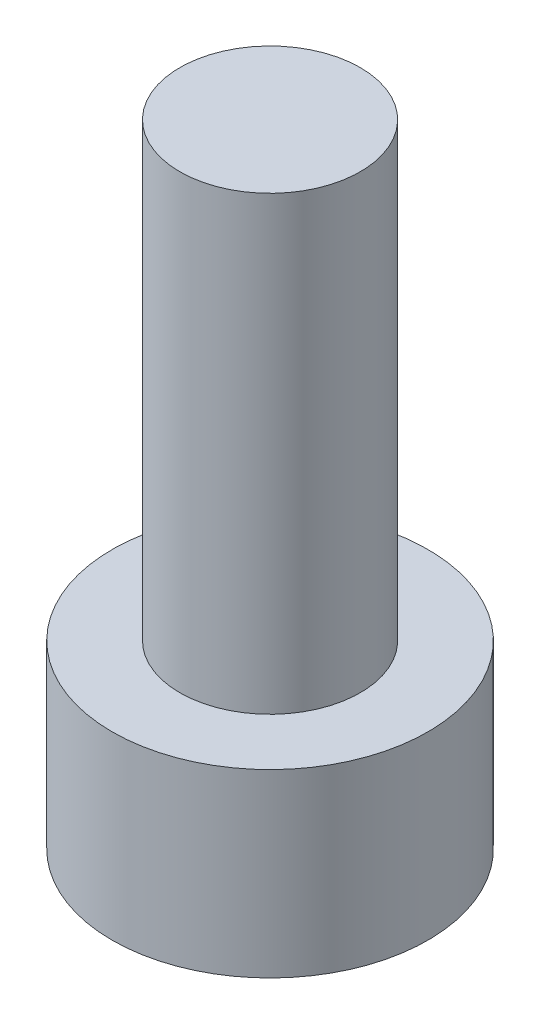
ISO-10303-21;
HEADER;
FILE_DESCRIPTION(('STEP AP214'),'2;1');
FILE_NAME('part.step','',(''),(''),'','','');
FILE_SCHEMA(('AUTOMOTIVE_DESIGN { 1 0 10303 214 1 1 1 1 }'));
ENDSEC;
DATA;
#1=APPLICATION_CONTEXT('core data for automotive mechanical design processes');
#2=APPLICATION_PROTOCOL_DEFINITION('international standard','automotive_design',2000,#1);
#3=PRODUCT_CONTEXT('',#1,'mechanical');
#4=PRODUCT('Part','Part','',(#3));
#5=PRODUCT_RELATED_PRODUCT_CATEGORY('part','',(#4));
#6=PRODUCT_DEFINITION_FORMATION('','',#4);
#7=PRODUCT_DEFINITION_CONTEXT('part definition',#1,'design');
#8=PRODUCT_DEFINITION('design','',#6,#7);
#9=PRODUCT_DEFINITION_SHAPE('','',#8);
#10=(LENGTH_UNIT() NAMED_UNIT(*) SI_UNIT(.MILLI.,.METRE.));
#11=(NAMED_UNIT(*) PLANE_ANGLE_UNIT() SI_UNIT($,.RADIAN.));
#12=(NAMED_UNIT(*) SI_UNIT($,.STERADIAN.) SOLID_ANGLE_UNIT());
#13=UNCERTAINTY_MEASURE_WITH_UNIT(LENGTH_MEASURE(1.E-05),#10,'distance_accuracy_value','');
#14=(GEOMETRIC_REPRESENTATION_CONTEXT(3) GLOBAL_UNCERTAINTY_ASSIGNED_CONTEXT((#13)) GLOBAL_UNIT_ASSIGNED_CONTEXT((#10,
#11,#12)) REPRESENTATION_CONTEXT('',''));
#15=CARTESIAN_POINT('',(0.,0.,0.));
#16=DIRECTION('',(0.,0.,1.));
#17=DIRECTION('',(1.,0.,0.));
#18=AXIS2_PLACEMENT_3D('',#15,#16,#17);
#19=CARTESIAN_POINT('',(0.,4.,0.));
#20=DIRECTION('',(0.,-1.,0.));
#21=DIRECTION('',(0.,0.,-1.));
#22=AXIS2_PLACEMENT_3D('',#19,#20,#21);
#23=CYLINDRICAL_SURFACE('',#22,3.5);
#24=CARTESIAN_POINT('',(0.,4.,0.));
#25=DIRECTION('',(0.,1.,0.));
#26=DIRECTION('',(0.,0.,1.));
#27=AXIS2_PLACEMENT_3D('',#24,#25,#26);
#28=CIRCLE('',#27,3.5);
#29=CARTESIAN_POINT('',(0.,4.,3.5));
#30=VERTEX_POINT('',#29);
#31=EDGE_CURVE('E44',#30,#30,#28,.T.);
#32=ORIENTED_EDGE('',*,*,#31,.F.);
#33=EDGE_LOOP('',(#32));
#34=FACE_BOUND('',#33,.T.);
#35=CARTESIAN_POINT('',(0.,0.,0.));
#36=DIRECTION('',(0.,1.,0.));
#37=DIRECTION('',(0.,0.,1.));
#38=AXIS2_PLACEMENT_3D('',#35,#36,#37);
#39=CIRCLE('',#38,3.5);
#40=CARTESIAN_POINT('',(0.,0.,3.5));
#41=VERTEX_POINT('',#40);
#42=EDGE_CURVE('E40',#41,#41,#39,.T.);
#43=ORIENTED_EDGE('',*,*,#42,.T.);
#44=EDGE_LOOP('',(#43));
#45=FACE_BOUND('',#44,.T.);
#46=ADVANCED_FACE('F37',(#34,#45),#23,.T.);
#47=CARTESIAN_POINT('',(0.,4.,0.));
#48=DIRECTION('',(0.,1.,0.));
#49=DIRECTION('',(0.,0.,1.));
#50=AXIS2_PLACEMENT_3D('',#47,#48,#49);
#51=PLANE('',#50);
#52=CARTESIAN_POINT('',(0.,4.,0.));
#53=DIRECTION('',(0.,1.,0.));
#54=DIRECTION('',(0.,0.,1.));
#55=AXIS2_PLACEMENT_3D('',#52,#53,#54);
#56=CIRCLE('',#55,2.);
#57=CARTESIAN_POINT('',(0.,4.,2.));
#58=VERTEX_POINT('',#57);
#59=EDGE_CURVE('E10',#58,#58,#56,.T.);
#60=ORIENTED_EDGE('',*,*,#59,.F.);
#61=EDGE_LOOP('',(#60));
#62=FACE_BOUND('',#61,.T.);
#63=ORIENTED_EDGE('',*,*,#31,.T.);
#64=EDGE_LOOP('',(#63));
#65=FACE_BOUND('',#64,.T.);
#66=ADVANCED_FACE('F61',(#62,#65),#51,.T.);
#67=CARTESIAN_POINT('',(0.,0.,0.));
#68=DIRECTION('',(0.,1.,0.));
#69=DIRECTION('',(0.,0.,1.));
#70=AXIS2_PLACEMENT_3D('',#67,#68,#69);
#71=PLANE('',#70);
#72=ORIENTED_EDGE('',*,*,#42,.F.);
#73=EDGE_LOOP('',(#72));
#74=FACE_BOUND('',#73,.T.);
#75=ADVANCED_FACE('F58',(#74),#71,.F.);
#76=CARTESIAN_POINT('',(0.,14.,0.));
#77=DIRECTION('',(0.,-1.,0.));
#78=DIRECTION('',(0.,0.,-1.));
#79=AXIS2_PLACEMENT_3D('',#76,#77,#78);
#80=CYLINDRICAL_SURFACE('',#79,2.);
#81=CARTESIAN_POINT('',(0.,14.,0.));
#82=DIRECTION('',(0.,1.,0.));
#83=DIRECTION('',(0.,0.,1.));
#84=AXIS2_PLACEMENT_3D('',#81,#82,#83);
#85=CIRCLE('',#84,2.);
#86=CARTESIAN_POINT('',(0.,14.,2.));
#87=VERTEX_POINT('',#86);
#88=EDGE_CURVE('E50',#87,#87,#85,.T.);
#89=ORIENTED_EDGE('',*,*,#88,.F.);
#90=EDGE_LOOP('',(#89));
#91=FACE_BOUND('',#90,.T.);
#92=ORIENTED_EDGE('',*,*,#59,.T.);
#93=EDGE_LOOP('',(#92));
#94=FACE_BOUND('',#93,.T.);
#95=ADVANCED_FACE('F60',(#91,#94),#80,.T.);
#96=CARTESIAN_POINT('',(0.,14.,0.));
#97=DIRECTION('',(0.,1.,0.));
#98=DIRECTION('',(0.,0.,1.));
#99=AXIS2_PLACEMENT_3D('',#96,#97,#98);
#100=PLANE('',#99);
#101=ORIENTED_EDGE('',*,*,#88,.T.);
#102=EDGE_LOOP('',(#101));
#103=FACE_BOUND('',#102,.T.);
#104=ADVANCED_FACE('F66',(#103),#100,.T.);
#105=CLOSED_SHELL('',(#46,#66,#75,#95,#104));
#106=MANIFOLD_SOLID_BREP('B2',#105);
#107=ADVANCED_BREP_SHAPE_REPRESENTATION('',(#18,#106),#14);
#108=SHAPE_DEFINITION_REPRESENTATION(#9,#107);
ENDSEC;
END-ISO-10303-21;
